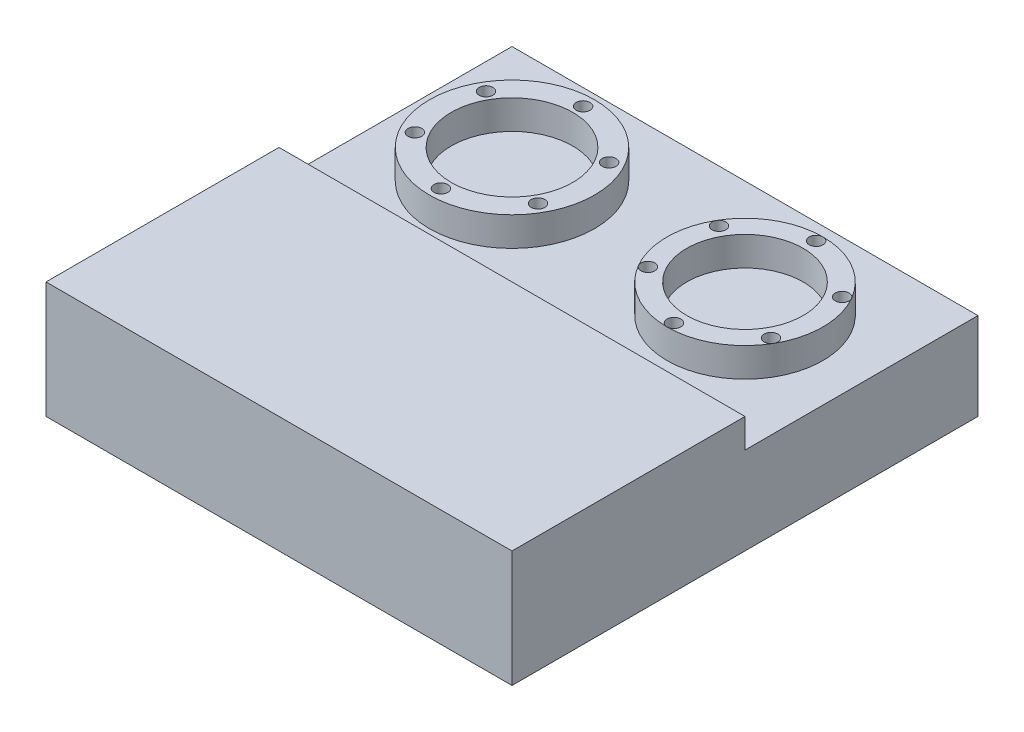
ISO-10303-21;
HEADER;
FILE_DESCRIPTION(('STEP AP214'),'2;1');
FILE_NAME('part.step','',(''),(''),'','','');
FILE_SCHEMA(('AUTOMOTIVE_DESIGN { 1 0 10303 214 1 1 1 1 }'));
ENDSEC;
DATA;
#1=APPLICATION_CONTEXT('core data for automotive mechanical design processes');
#2=APPLICATION_PROTOCOL_DEFINITION('international standard','automotive_design',2000,#1);
#3=PRODUCT_CONTEXT('',#1,'mechanical');
#4=PRODUCT('Part','Part','',(#3));
#5=PRODUCT_RELATED_PRODUCT_CATEGORY('part','',(#4));
#6=PRODUCT_DEFINITION_FORMATION('','',#4);
#7=PRODUCT_DEFINITION_CONTEXT('part definition',#1,'design');
#8=PRODUCT_DEFINITION('design','',#6,#7);
#9=PRODUCT_DEFINITION_SHAPE('','',#8);
#10=(LENGTH_UNIT() NAMED_UNIT(*) SI_UNIT(.MILLI.,.METRE.));
#11=(NAMED_UNIT(*) PLANE_ANGLE_UNIT() SI_UNIT($,.RADIAN.));
#12=(NAMED_UNIT(*) SI_UNIT($,.STERADIAN.) SOLID_ANGLE_UNIT());
#13=UNCERTAINTY_MEASURE_WITH_UNIT(LENGTH_MEASURE(1.E-05),#10,'distance_accuracy_value','');
#14=(GEOMETRIC_REPRESENTATION_CONTEXT(3) GLOBAL_UNCERTAINTY_ASSIGNED_CONTEXT((#13)) GLOBAL_UNIT_ASSIGNED_CONTEXT((#10,
#11,#12)) REPRESENTATION_CONTEXT('',''));
#15=CARTESIAN_POINT('',(0.,0.,0.));
#16=DIRECTION('',(0.,0.,1.));
#17=DIRECTION('',(1.,0.,0.));
#18=AXIS2_PLACEMENT_3D('',#15,#16,#17);
#19=CARTESIAN_POINT('',(0.,19.05,0.));
#20=DIRECTION('',(0.,1.,0.));
#21=DIRECTION('',(0.,0.,1.));
#22=AXIS2_PLACEMENT_3D('',#19,#20,#21);
#23=PLANE('',#22);
#24=CARTESIAN_POINT('',(25.4,19.05,-25.4));
#25=DIRECTION('',(0.,1.,0.));
#26=DIRECTION('',(0.,0.,1.));
#27=AXIS2_PLACEMENT_3D('',#24,#25,#26);
#28=CIRCLE('',#27,17.005);
#29=CARTESIAN_POINT('',(25.4,19.05,-8.39500000000004));
#30=VERTEX_POINT('',#29);
#31=EDGE_CURVE('E301',#30,#30,#28,.T.);
#32=ORIENTED_EDGE('',*,*,#31,.F.);
#33=EDGE_LOOP('',(#32));
#34=FACE_BOUND('',#33,.T.);
#35=CARTESIAN_POINT('',(-25.4,19.05,-25.4));
#36=DIRECTION('',(0.,1.,0.));
#37=DIRECTION('',(0.,0.,1.));
#38=AXIS2_PLACEMENT_3D('',#35,#36,#37);
#39=CIRCLE('',#38,18.);
#40=CARTESIAN_POINT('',(-25.4,19.05,-7.40000000000003));
#41=VERTEX_POINT('',#40);
#42=EDGE_CURVE('E326',#41,#41,#39,.T.);
#43=ORIENTED_EDGE('',*,*,#42,.F.);
#44=EDGE_LOOP('',(#43));
#45=FACE_BOUND('',#44,.T.);
#46=DIRECTION('',(0.,0.,1.));
#47=VECTOR('',#46,1.);
#48=CARTESIAN_POINT('',(-50.8,19.05,50.8));
#49=LINE('',#48,#47);
#50=CARTESIAN_POINT('',(-50.8,19.05,-50.8));
#51=VERTEX_POINT('',#50);
#52=CARTESIAN_POINT('',(-50.8,19.05,0.));
#53=VERTEX_POINT('',#52);
#54=EDGE_CURVE('E90',#51,#53,#49,.T.);
#55=ORIENTED_EDGE('',*,*,#54,.T.);
#56=DIRECTION('',(-1.,0.,0.));
#57=VECTOR('',#56,1.);
#58=CARTESIAN_POINT('',(-50.8,19.05,0.));
#59=LINE('',#58,#57);
#60=CARTESIAN_POINT('',(50.8,19.05,0.));
#61=VERTEX_POINT('',#60);
#62=EDGE_CURVE('E290',#61,#53,#59,.T.);
#63=ORIENTED_EDGE('',*,*,#62,.F.);
#64=DIRECTION('',(0.,0.,-1.));
#65=VECTOR('',#64,1.);
#66=CARTESIAN_POINT('',(50.8,19.05,50.8));
#67=LINE('',#66,#65);
#68=CARTESIAN_POINT('',(50.8,19.05,-50.8));
#69=VERTEX_POINT('',#68);
#70=EDGE_CURVE('E350',#61,#69,#67,.T.);
#71=ORIENTED_EDGE('',*,*,#70,.T.);
#72=DIRECTION('',(-1.,0.,0.));
#73=VECTOR('',#72,1.);
#74=CARTESIAN_POINT('',(50.8,19.05,-50.8));
#75=LINE('',#74,#73);
#76=EDGE_CURVE('E61',#69,#51,#75,.T.);
#77=ORIENTED_EDGE('',*,*,#76,.T.);
#78=EDGE_LOOP('',(#55,#63,#71,#77));
#79=FACE_BOUND('',#78,.T.);
#80=ADVANCED_FACE('F37',(#34,#45,#79),#23,.T.);
#81=CARTESIAN_POINT('',(-50.8,19.05,50.8));
#82=DIRECTION('',(1.,0.,0.));
#83=DIRECTION('',(0.,0.,-1.));
#84=AXIS2_PLACEMENT_3D('',#81,#82,#83);
#85=PLANE('',#84);
#86=DIRECTION('',(0.,0.,1.));
#87=VECTOR('',#86,1.);
#88=CARTESIAN_POINT('',(-50.8,0.,50.8));
#89=LINE('',#88,#87);
#90=CARTESIAN_POINT('',(-50.8,0.,-50.8));
#91=VERTEX_POINT('',#90);
#92=CARTESIAN_POINT('',(-50.8,0.,50.8));
#93=VERTEX_POINT('',#92);
#94=EDGE_CURVE('E96',#91,#93,#89,.T.);
#95=ORIENTED_EDGE('',*,*,#94,.T.);
#96=DIRECTION('',(0.,-1.,0.));
#97=VECTOR('',#96,1.);
#98=CARTESIAN_POINT('',(-50.8,19.05,50.8));
#99=LINE('',#98,#97);
#100=CARTESIAN_POINT('',(-50.8,25.4,50.8));
#101=VERTEX_POINT('',#100);
#102=EDGE_CURVE('E116',#101,#93,#99,.T.);
#103=ORIENTED_EDGE('',*,*,#102,.F.);
#104=DIRECTION('',(0.,0.,1.));
#105=VECTOR('',#104,1.);
#106=CARTESIAN_POINT('',(-50.8,25.4,50.8));
#107=LINE('',#106,#105);
#108=CARTESIAN_POINT('',(-50.8,25.4,0.));
#109=VERTEX_POINT('',#108);
#110=EDGE_CURVE('E280',#109,#101,#107,.T.);
#111=ORIENTED_EDGE('',*,*,#110,.F.);
#112=DIRECTION('',(0.,-1.,0.));
#113=VECTOR('',#112,1.);
#114=CARTESIAN_POINT('',(-50.8,25.4,0.));
#115=LINE('',#114,#113);
#116=EDGE_CURVE('E297',#109,#53,#115,.T.);
#117=ORIENTED_EDGE('',*,*,#116,.T.);
#118=ORIENTED_EDGE('',*,*,#54,.F.);
#119=DIRECTION('',(0.,-1.,0.));
#120=VECTOR('',#119,1.);
#121=CARTESIAN_POINT('',(-50.8,19.05,-50.8));
#122=LINE('',#121,#120);
#123=EDGE_CURVE('E83',#51,#91,#122,.T.);
#124=ORIENTED_EDGE('',*,*,#123,.T.);
#125=EDGE_LOOP('',(#95,#103,#111,#117,#118,#124));
#126=FACE_BOUND('',#125,.T.);
#127=ADVANCED_FACE('F39',(#126),#85,.F.);
#128=CARTESIAN_POINT('',(50.8,19.05,50.8));
#129=DIRECTION('',(0.,0.,-1.));
#130=DIRECTION('',(-1.,0.,0.));
#131=AXIS2_PLACEMENT_3D('',#128,#129,#130);
#132=PLANE('',#131);
#133=DIRECTION('',(1.,0.,0.));
#134=VECTOR('',#133,1.);
#135=CARTESIAN_POINT('',(50.8,0.,50.8));
#136=LINE('',#135,#134);
#137=CARTESIAN_POINT('',(50.8,0.,50.8));
#138=VERTEX_POINT('',#137);
#139=EDGE_CURVE('E100',#93,#138,#136,.T.);
#140=ORIENTED_EDGE('',*,*,#139,.T.);
#141=DIRECTION('',(0.,-1.,0.));
#142=VECTOR('',#141,1.);
#143=CARTESIAN_POINT('',(50.8,19.05,50.8));
#144=LINE('',#143,#142);
#145=CARTESIAN_POINT('',(50.8,25.4,50.8));
#146=VERTEX_POINT('',#145);
#147=EDGE_CURVE('E113',#146,#138,#144,.T.);
#148=ORIENTED_EDGE('',*,*,#147,.F.);
#149=DIRECTION('',(1.,0.,0.));
#150=VECTOR('',#149,1.);
#151=CARTESIAN_POINT('',(-50.8,25.4,50.8));
#152=LINE('',#151,#150);
#153=EDGE_CURVE('E284',#101,#146,#152,.T.);
#154=ORIENTED_EDGE('',*,*,#153,.F.);
#155=ORIENTED_EDGE('',*,*,#102,.T.);
#156=EDGE_LOOP('',(#140,#148,#154,#155));
#157=FACE_BOUND('',#156,.T.);
#158=ADVANCED_FACE('F179',(#157),#132,.F.);
#159=CARTESIAN_POINT('',(50.8,19.05,50.8));
#160=DIRECTION('',(-1.,0.,0.));
#161=DIRECTION('',(0.,0.,1.));
#162=AXIS2_PLACEMENT_3D('',#159,#160,#161);
#163=PLANE('',#162);
#164=DIRECTION('',(0.,0.,-1.));
#165=VECTOR('',#164,1.);
#166=CARTESIAN_POINT('',(50.8,0.,50.8));
#167=LINE('',#166,#165);
#168=CARTESIAN_POINT('',(50.8,0.,-50.8));
#169=VERTEX_POINT('',#168);
#170=EDGE_CURVE('E91',#138,#169,#167,.T.);
#171=ORIENTED_EDGE('',*,*,#170,.T.);
#172=DIRECTION('',(0.,-1.,0.));
#173=VECTOR('',#172,1.);
#174=CARTESIAN_POINT('',(50.8,19.05,-50.8));
#175=LINE('',#174,#173);
#176=EDGE_CURVE('E86',#69,#169,#175,.T.);
#177=ORIENTED_EDGE('',*,*,#176,.F.);
#178=ORIENTED_EDGE('',*,*,#70,.F.);
#179=DIRECTION('',(0.,-1.,0.));
#180=VECTOR('',#179,1.);
#181=CARTESIAN_POINT('',(50.8,25.4,0.));
#182=LINE('',#181,#180);
#183=CARTESIAN_POINT('',(50.8,25.4,0.));
#184=VERTEX_POINT('',#183);
#185=EDGE_CURVE('E52',#184,#61,#182,.T.);
#186=ORIENTED_EDGE('',*,*,#185,.F.);
#187=DIRECTION('',(0.,0.,-1.));
#188=VECTOR('',#187,1.);
#189=CARTESIAN_POINT('',(50.8,25.4,50.8));
#190=LINE('',#189,#188);
#191=EDGE_CURVE('E292',#146,#184,#190,.T.);
#192=ORIENTED_EDGE('',*,*,#191,.F.);
#193=ORIENTED_EDGE('',*,*,#147,.T.);
#194=EDGE_LOOP('',(#171,#177,#178,#186,#192,#193));
#195=FACE_BOUND('',#194,.T.);
#196=ADVANCED_FACE('F353',(#195),#163,.F.);
#197=CARTESIAN_POINT('',(50.8,19.05,-50.8));
#198=DIRECTION('',(0.,0.,1.));
#199=DIRECTION('',(1.,0.,0.));
#200=AXIS2_PLACEMENT_3D('',#197,#198,#199);
#201=PLANE('',#200);
#202=DIRECTION('',(-1.,0.,0.));
#203=VECTOR('',#202,1.);
#204=CARTESIAN_POINT('',(50.8,0.,-50.8));
#205=LINE('',#204,#203);
#206=EDGE_CURVE('E80',#169,#91,#205,.T.);
#207=ORIENTED_EDGE('',*,*,#206,.T.);
#208=ORIENTED_EDGE('',*,*,#123,.F.);
#209=ORIENTED_EDGE('',*,*,#76,.F.);
#210=ORIENTED_EDGE('',*,*,#176,.T.);
#211=EDGE_LOOP('',(#207,#208,#209,#210));
#212=FACE_BOUND('',#211,.T.);
#213=ADVANCED_FACE('F82',(#212),#201,.F.);
#214=CARTESIAN_POINT('',(0.,0.,0.));
#215=DIRECTION('',(0.,1.,0.));
#216=DIRECTION('',(0.,0.,1.));
#217=AXIS2_PLACEMENT_3D('',#214,#215,#216);
#218=PLANE('',#217);
#219=ORIENTED_EDGE('',*,*,#94,.F.);
#220=ORIENTED_EDGE('',*,*,#206,.F.);
#221=ORIENTED_EDGE('',*,*,#170,.F.);
#222=ORIENTED_EDGE('',*,*,#139,.F.);
#223=EDGE_LOOP('',(#219,#220,#221,#222));
#224=FACE_BOUND('',#223,.T.);
#225=ADVANCED_FACE('F99',(#224),#218,.F.);
#226=CARTESIAN_POINT('',(-25.4,25.4,-25.4));
#227=DIRECTION('',(0.,-1.,0.));
#228=DIRECTION('',(0.,0.,-1.));
#229=AXIS2_PLACEMENT_3D('',#226,#227,#228);
#230=CYLINDRICAL_SURFACE('',#229,13.25);
#231=CARTESIAN_POINT('',(-25.4,25.4,-25.4));
#232=DIRECTION('',(0.,1.,0.));
#233=DIRECTION('',(0.,0.,1.));
#234=AXIS2_PLACEMENT_3D('',#231,#232,#233);
#235=CIRCLE('',#234,13.25);
#236=CARTESIAN_POINT('',(-25.4,25.4,-12.15));
#237=VERTEX_POINT('',#236);
#238=EDGE_CURVE('E106',#237,#237,#235,.T.);
#239=ORIENTED_EDGE('',*,*,#238,.T.);
#240=EDGE_LOOP('',(#239));
#241=FACE_BOUND('',#240,.T.);
#242=CARTESIAN_POINT('',(-25.4,19.05,-25.4));
#243=DIRECTION('',(0.,1.,0.));
#244=DIRECTION('',(0.,0.,1.));
#245=AXIS2_PLACEMENT_3D('',#242,#243,#244);
#246=CIRCLE('',#245,13.25);
#247=CARTESIAN_POINT('',(-25.4,19.05,-12.15));
#248=VERTEX_POINT('',#247);
#249=EDGE_CURVE('E136',#248,#248,#246,.F.);
#250=ORIENTED_EDGE('',*,*,#249,.T.);
#251=EDGE_LOOP('',(#250));
#252=FACE_BOUND('',#251,.T.);
#253=ADVANCED_FACE('F226',(#241,#252),#230,.F.);
#254=CARTESIAN_POINT('',(-25.4,25.4,-40.9));
#255=DIRECTION('',(0.,-1.,0.));
#256=DIRECTION('',(0.,0.,-1.));
#257=AXIS2_PLACEMENT_3D('',#254,#255,#256);
#258=CYLINDRICAL_SURFACE('',#257,1.5);
#259=CARTESIAN_POINT('',(-25.4,25.4,-40.9));
#260=DIRECTION('',(0.,1.,0.));
#261=DIRECTION('',(0.,0.,1.));
#262=AXIS2_PLACEMENT_3D('',#259,#260,#261);
#263=CIRCLE('',#262,1.5);
#264=CARTESIAN_POINT('',(-25.4,25.4,-39.4));
#265=VERTEX_POINT('',#264);
#266=EDGE_CURVE('E343',#265,#265,#263,.T.);
#267=ORIENTED_EDGE('',*,*,#266,.T.);
#268=EDGE_LOOP('',(#267));
#269=FACE_BOUND('',#268,.T.);
#270=CARTESIAN_POINT('',(-25.4,19.05,-40.9));
#271=DIRECTION('',(0.,1.,0.));
#272=DIRECTION('',(0.,0.,1.));
#273=AXIS2_PLACEMENT_3D('',#270,#271,#272);
#274=CIRCLE('',#273,1.5);
#275=CARTESIAN_POINT('',(-25.4,19.05,-39.4));
#276=VERTEX_POINT('',#275);
#277=EDGE_CURVE('E133',#276,#276,#274,.F.);
#278=ORIENTED_EDGE('',*,*,#277,.T.);
#279=EDGE_LOOP('',(#278));
#280=FACE_BOUND('',#279,.T.);
#281=ADVANCED_FACE('F222',(#269,#280),#258,.F.);
#282=CARTESIAN_POINT('',(-11.9766062413412,25.4,-33.15));
#283=DIRECTION('',(0.,-1.,0.));
#284=DIRECTION('',(0.,0.,-1.));
#285=AXIS2_PLACEMENT_3D('',#282,#283,#284);
#286=CYLINDRICAL_SURFACE('',#285,1.5);
#287=CARTESIAN_POINT('',(-11.9766062413412,25.4,-33.15));
#288=DIRECTION('',(0.,1.,0.));
#289=DIRECTION('',(0.,0.,1.));
#290=AXIS2_PLACEMENT_3D('',#287,#288,#289);
#291=CIRCLE('',#290,1.5);
#292=CARTESIAN_POINT('',(-11.9766062413412,25.4,-31.65));
#293=VERTEX_POINT('',#292);
#294=EDGE_CURVE('E340',#293,#293,#291,.T.);
#295=ORIENTED_EDGE('',*,*,#294,.T.);
#296=EDGE_LOOP('',(#295));
#297=FACE_BOUND('',#296,.T.);
#298=CARTESIAN_POINT('',(-11.9766062413412,19.05,-33.15));
#299=DIRECTION('',(0.,1.,0.));
#300=DIRECTION('',(0.,0.,1.));
#301=AXIS2_PLACEMENT_3D('',#298,#299,#300);
#302=CIRCLE('',#301,1.5);
#303=CARTESIAN_POINT('',(-11.9766062413412,19.05,-31.65));
#304=VERTEX_POINT('',#303);
#305=EDGE_CURVE('E130',#304,#304,#302,.F.);
#306=ORIENTED_EDGE('',*,*,#305,.T.);
#307=EDGE_LOOP('',(#306));
#308=FACE_BOUND('',#307,.T.);
#309=ADVANCED_FACE('F218',(#297,#308),#286,.F.);
#310=CARTESIAN_POINT('',(-11.9766062413412,25.4,-17.65));
#311=DIRECTION('',(0.,-1.,0.));
#312=DIRECTION('',(0.,0.,-1.));
#313=AXIS2_PLACEMENT_3D('',#310,#311,#312);
#314=CYLINDRICAL_SURFACE('',#313,1.5);
#315=CARTESIAN_POINT('',(-11.9766062413412,25.4,-17.65));
#316=DIRECTION('',(0.,1.,0.));
#317=DIRECTION('',(0.,0.,1.));
#318=AXIS2_PLACEMENT_3D('',#315,#316,#317);
#319=CIRCLE('',#318,1.5);
#320=CARTESIAN_POINT('',(-11.9766062413412,25.4,-16.15));
#321=VERTEX_POINT('',#320);
#322=EDGE_CURVE('E337',#321,#321,#319,.T.);
#323=ORIENTED_EDGE('',*,*,#322,.T.);
#324=EDGE_LOOP('',(#323));
#325=FACE_BOUND('',#324,.T.);
#326=CARTESIAN_POINT('',(-11.9766062413412,19.05,-17.65));
#327=DIRECTION('',(0.,1.,0.));
#328=DIRECTION('',(0.,0.,1.));
#329=AXIS2_PLACEMENT_3D('',#326,#327,#328);
#330=CIRCLE('',#329,1.5);
#331=CARTESIAN_POINT('',(-11.9766062413412,19.05,-16.15));
#332=VERTEX_POINT('',#331);
#333=EDGE_CURVE('E127',#332,#332,#330,.F.);
#334=ORIENTED_EDGE('',*,*,#333,.T.);
#335=EDGE_LOOP('',(#334));
#336=FACE_BOUND('',#335,.T.);
#337=ADVANCED_FACE('F214',(#325,#336),#314,.F.);
#338=CARTESIAN_POINT('',(-25.4,25.4,-9.90000000000005));
#339=DIRECTION('',(0.,-1.,0.));
#340=DIRECTION('',(0.,0.,-1.));
#341=AXIS2_PLACEMENT_3D('',#338,#339,#340);
#342=CYLINDRICAL_SURFACE('',#341,1.5);
#343=CARTESIAN_POINT('',(-25.4,25.4,-9.90000000000005));
#344=DIRECTION('',(0.,1.,0.));
#345=DIRECTION('',(0.,0.,1.));
#346=AXIS2_PLACEMENT_3D('',#343,#344,#345);
#347=CIRCLE('',#346,1.5);
#348=CARTESIAN_POINT('',(-25.4,25.4,-8.40000000000004));
#349=VERTEX_POINT('',#348);
#350=EDGE_CURVE('E334',#349,#349,#347,.T.);
#351=ORIENTED_EDGE('',*,*,#350,.T.);
#352=EDGE_LOOP('',(#351));
#353=FACE_BOUND('',#352,.T.);
#354=CARTESIAN_POINT('',(-25.4,19.05,-9.90000000000005));
#355=DIRECTION('',(0.,1.,0.));
#356=DIRECTION('',(0.,0.,1.));
#357=AXIS2_PLACEMENT_3D('',#354,#355,#356);
#358=CIRCLE('',#357,1.5);
#359=CARTESIAN_POINT('',(-25.4,19.05,-8.40000000000004));
#360=VERTEX_POINT('',#359);
#361=EDGE_CURVE('E124',#360,#360,#358,.F.);
#362=ORIENTED_EDGE('',*,*,#361,.T.);
#363=EDGE_LOOP('',(#362));
#364=FACE_BOUND('',#363,.T.);
#365=ADVANCED_FACE('F207',(#353,#364),#342,.F.);
#366=CARTESIAN_POINT('',(-38.8233937586588,25.4,-17.65));
#367=DIRECTION('',(0.,-1.,0.));
#368=DIRECTION('',(0.,0.,-1.));
#369=AXIS2_PLACEMENT_3D('',#366,#367,#368);
#370=CYLINDRICAL_SURFACE('',#369,1.50000000000001);
#371=CARTESIAN_POINT('',(-38.8233937586588,25.4,-17.65));
#372=DIRECTION('',(0.,1.,0.));
#373=DIRECTION('',(0.,0.,1.));
#374=AXIS2_PLACEMENT_3D('',#371,#372,#373);
#375=CIRCLE('',#374,1.50000000000001);
#376=CARTESIAN_POINT('',(-38.8233937586588,25.4,-16.15));
#377=VERTEX_POINT('',#376);
#378=EDGE_CURVE('E331',#377,#377,#375,.T.);
#379=ORIENTED_EDGE('',*,*,#378,.T.);
#380=EDGE_LOOP('',(#379));
#381=FACE_BOUND('',#380,.T.);
#382=CARTESIAN_POINT('',(-38.8233937586588,19.05,-17.65));
#383=DIRECTION('',(0.,1.,0.));
#384=DIRECTION('',(0.,0.,1.));
#385=AXIS2_PLACEMENT_3D('',#382,#383,#384);
#386=CIRCLE('',#385,1.50000000000001);
#387=CARTESIAN_POINT('',(-38.8233937586588,19.05,-16.15));
#388=VERTEX_POINT('',#387);
#389=EDGE_CURVE('E121',#388,#388,#386,.F.);
#390=ORIENTED_EDGE('',*,*,#389,.T.);
#391=EDGE_LOOP('',(#390));
#392=FACE_BOUND('',#391,.T.);
#393=ADVANCED_FACE('F199',(#381,#392),#370,.F.);
#394=CARTESIAN_POINT('',(-38.8233937586588,25.4,-33.15));
#395=DIRECTION('',(0.,-1.,0.));
#396=DIRECTION('',(0.,0.,-1.));
#397=AXIS2_PLACEMENT_3D('',#394,#395,#396);
#398=CYLINDRICAL_SURFACE('',#397,1.50000000000001);
#399=CARTESIAN_POINT('',(-38.8233937586588,25.4,-33.15));
#400=DIRECTION('',(0.,1.,0.));
#401=DIRECTION('',(0.,0.,1.));
#402=AXIS2_PLACEMENT_3D('',#399,#400,#401);
#403=CIRCLE('',#402,1.50000000000001);
#404=CARTESIAN_POINT('',(-38.8233937586588,25.4,-31.65));
#405=VERTEX_POINT('',#404);
#406=EDGE_CURVE('E329',#405,#405,#403,.T.);
#407=ORIENTED_EDGE('',*,*,#406,.T.);
#408=EDGE_LOOP('',(#407));
#409=FACE_BOUND('',#408,.T.);
#410=CARTESIAN_POINT('',(-38.8233937586588,19.05,-33.15));
#411=DIRECTION('',(0.,1.,0.));
#412=DIRECTION('',(0.,0.,1.));
#413=AXIS2_PLACEMENT_3D('',#410,#411,#412);
#414=CIRCLE('',#413,1.50000000000001);
#415=CARTESIAN_POINT('',(-38.8233937586588,19.05,-31.65));
#416=VERTEX_POINT('',#415);
#417=EDGE_CURVE('E118',#416,#416,#414,.F.);
#418=ORIENTED_EDGE('',*,*,#417,.T.);
#419=EDGE_LOOP('',(#418));
#420=FACE_BOUND('',#419,.T.);
#421=ADVANCED_FACE('F197',(#409,#420),#398,.F.);
#422=CARTESIAN_POINT('',(-25.4,25.4,-25.4));
#423=DIRECTION('',(0.,-1.,0.));
#424=DIRECTION('',(0.,0.,-1.));
#425=AXIS2_PLACEMENT_3D('',#422,#423,#424);
#426=CYLINDRICAL_SURFACE('',#425,18.);
#427=CARTESIAN_POINT('',(-25.4,25.4,-25.4));
#428=DIRECTION('',(0.,1.,0.));
#429=DIRECTION('',(0.,0.,1.));
#430=AXIS2_PLACEMENT_3D('',#427,#428,#429);
#431=CIRCLE('',#430,18.);
#432=CARTESIAN_POINT('',(-25.4,25.4,-7.40000000000003));
#433=VERTEX_POINT('',#432);
#434=EDGE_CURVE('E102',#433,#433,#431,.T.);
#435=ORIENTED_EDGE('',*,*,#434,.F.);
#436=EDGE_LOOP('',(#435));
#437=FACE_BOUND('',#436,.T.);
#438=ORIENTED_EDGE('',*,*,#42,.T.);
#439=EDGE_LOOP('',(#438));
#440=FACE_BOUND('',#439,.T.);
#441=ADVANCED_FACE('F192',(#437,#440),#426,.T.);
#442=CARTESIAN_POINT('',(0.,25.4,0.));
#443=DIRECTION('',(0.,1.,0.));
#444=DIRECTION('',(0.,0.,1.));
#445=AXIS2_PLACEMENT_3D('',#442,#443,#444);
#446=PLANE('',#445);
#447=ORIENTED_EDGE('',*,*,#406,.F.);
#448=EDGE_LOOP('',(#447));
#449=FACE_BOUND('',#448,.T.);
#450=ORIENTED_EDGE('',*,*,#378,.F.);
#451=EDGE_LOOP('',(#450));
#452=FACE_BOUND('',#451,.T.);
#453=ORIENTED_EDGE('',*,*,#350,.F.);
#454=EDGE_LOOP('',(#453));
#455=FACE_BOUND('',#454,.T.);
#456=ORIENTED_EDGE('',*,*,#322,.F.);
#457=EDGE_LOOP('',(#456));
#458=FACE_BOUND('',#457,.T.);
#459=ORIENTED_EDGE('',*,*,#294,.F.);
#460=EDGE_LOOP('',(#459));
#461=FACE_BOUND('',#460,.T.);
#462=ORIENTED_EDGE('',*,*,#266,.F.);
#463=EDGE_LOOP('',(#462));
#464=FACE_BOUND('',#463,.T.);
#465=ORIENTED_EDGE('',*,*,#238,.F.);
#466=EDGE_LOOP('',(#465));
#467=FACE_BOUND('',#466,.T.);
#468=ORIENTED_EDGE('',*,*,#434,.T.);
#469=EDGE_LOOP('',(#468));
#470=FACE_BOUND('',#469,.T.);
#471=ADVANCED_FACE('F184',(#449,#452,#455,#458,#461,#464,#467,#470),#446,.T.);
#472=ORIENTED_EDGE('',*,*,#417,.F.);
#473=EDGE_LOOP('',(#472));
#474=FACE_BOUND('',#473,.T.);
#475=ADVANCED_FACE('F175',(#474),#23,.T.);
#476=ORIENTED_EDGE('',*,*,#389,.F.);
#477=EDGE_LOOP('',(#476));
#478=FACE_BOUND('',#477,.T.);
#479=ADVANCED_FACE('F183',(#478),#23,.T.);
#480=ORIENTED_EDGE('',*,*,#361,.F.);
#481=EDGE_LOOP('',(#480));
#482=FACE_BOUND('',#481,.T.);
#483=ADVANCED_FACE('F190',(#482),#23,.T.);
#484=ORIENTED_EDGE('',*,*,#333,.F.);
#485=EDGE_LOOP('',(#484));
#486=FACE_BOUND('',#485,.T.);
#487=ADVANCED_FACE('F432',(#486),#23,.T.);
#488=ORIENTED_EDGE('',*,*,#305,.F.);
#489=EDGE_LOOP('',(#488));
#490=FACE_BOUND('',#489,.T.);
#491=ADVANCED_FACE('F441',(#490),#23,.T.);
#492=ORIENTED_EDGE('',*,*,#277,.F.);
#493=EDGE_LOOP('',(#492));
#494=FACE_BOUND('',#493,.T.);
#495=ADVANCED_FACE('F450',(#494),#23,.T.);
#496=ORIENTED_EDGE('',*,*,#249,.F.);
#497=EDGE_LOOP('',(#496));
#498=FACE_BOUND('',#497,.T.);
#499=ADVANCED_FACE('F258',(#498),#23,.T.);
#500=CARTESIAN_POINT('',(25.4,25.4,-25.4));
#501=DIRECTION('',(0.,-1.,0.));
#502=DIRECTION('',(0.,0.,-1.));
#503=AXIS2_PLACEMENT_3D('',#500,#501,#502);
#504=CYLINDRICAL_SURFACE('',#503,12.7);
#505=CARTESIAN_POINT('',(25.4,25.4,-25.4));
#506=DIRECTION('',(0.,1.,0.));
#507=DIRECTION('',(0.,0.,1.));
#508=AXIS2_PLACEMENT_3D('',#505,#506,#507);
#509=CIRCLE('',#508,12.7);
#510=CARTESIAN_POINT('',(25.4,25.4,-12.7));
#511=VERTEX_POINT('',#510);
#512=EDGE_CURVE('E320',#511,#511,#509,.T.);
#513=ORIENTED_EDGE('',*,*,#512,.T.);
#514=EDGE_LOOP('',(#513));
#515=FACE_BOUND('',#514,.T.);
#516=CARTESIAN_POINT('',(25.4,19.05,-25.4));
#517=DIRECTION('',(0.,1.,0.));
#518=DIRECTION('',(0.,0.,1.));
#519=AXIS2_PLACEMENT_3D('',#516,#517,#518);
#520=CIRCLE('',#519,12.7);
#521=CARTESIAN_POINT('',(25.4,19.05,-12.7));
#522=VERTEX_POINT('',#521);
#523=EDGE_CURVE('E11',#522,#522,#520,.F.);
#524=ORIENTED_EDGE('',*,*,#523,.T.);
#525=EDGE_LOOP('',(#524));
#526=FACE_BOUND('',#525,.T.);
#527=ADVANCED_FACE('F254',(#515,#526),#504,.F.);
#528=CARTESIAN_POINT('',(25.4,25.4,-40.9));
#529=DIRECTION('',(0.,-1.,0.));
#530=DIRECTION('',(0.,0.,-1.));
#531=AXIS2_PLACEMENT_3D('',#528,#529,#530);
#532=CYLINDRICAL_SURFACE('',#531,1.5);
#533=CARTESIAN_POINT('',(25.4,25.4,-40.9));
#534=DIRECTION('',(0.,1.,0.));
#535=DIRECTION('',(0.,0.,1.));
#536=AXIS2_PLACEMENT_3D('',#533,#534,#535);
#537=CIRCLE('',#536,1.5);
#538=CARTESIAN_POINT('',(25.4,25.4,-39.4));
#539=VERTEX_POINT('',#538);
#540=EDGE_CURVE('E317',#539,#539,#537,.T.);
#541=ORIENTED_EDGE('',*,*,#540,.T.);
#542=EDGE_LOOP('',(#541));
#543=FACE_BOUND('',#542,.T.);
#544=CARTESIAN_POINT('',(25.4,19.05,-40.9));
#545=DIRECTION('',(0.,1.,0.));
#546=DIRECTION('',(0.,0.,1.));
#547=AXIS2_PLACEMENT_3D('',#544,#545,#546);
#548=CIRCLE('',#547,1.5);
#549=CARTESIAN_POINT('',(25.4,19.05,-39.4));
#550=VERTEX_POINT('',#549);
#551=EDGE_CURVE('E45',#550,#550,#548,.F.);
#552=ORIENTED_EDGE('',*,*,#551,.T.);
#553=EDGE_LOOP('',(#552));
#554=FACE_BOUND('',#553,.T.);
#555=ADVANCED_FACE('F156',(#543,#554),#532,.F.);
#556=CARTESIAN_POINT('',(38.8233937586588,25.4,-33.15));
#557=DIRECTION('',(0.,-1.,0.));
#558=DIRECTION('',(0.,0.,-1.));
#559=AXIS2_PLACEMENT_3D('',#556,#557,#558);
#560=CYLINDRICAL_SURFACE('',#559,1.5);
#561=CARTESIAN_POINT('',(38.8233937586588,25.4,-33.15));
#562=DIRECTION('',(0.,1.,0.));
#563=DIRECTION('',(0.,0.,1.));
#564=AXIS2_PLACEMENT_3D('',#561,#562,#563);
#565=CIRCLE('',#564,1.5);
#566=CARTESIAN_POINT('',(38.8233937586588,25.4,-31.65));
#567=VERTEX_POINT('',#566);
#568=EDGE_CURVE('E314',#567,#567,#565,.T.);
#569=ORIENTED_EDGE('',*,*,#568,.T.);
#570=EDGE_LOOP('',(#569));
#571=FACE_BOUND('',#570,.T.);
#572=CARTESIAN_POINT('',(38.8233937586588,19.05,-33.15));
#573=DIRECTION('',(0.,1.,0.));
#574=DIRECTION('',(0.,0.,1.));
#575=AXIS2_PLACEMENT_3D('',#572,#573,#574);
#576=CIRCLE('',#575,1.5);
#577=CARTESIAN_POINT('',(38.8233937586588,19.05,-31.65));
#578=VERTEX_POINT('',#577);
#579=EDGE_CURVE('E151',#578,#578,#576,.F.);
#580=ORIENTED_EDGE('',*,*,#579,.T.);
#581=EDGE_LOOP('',(#580));
#582=FACE_BOUND('',#581,.T.);
#583=ADVANCED_FACE('F247',(#571,#582),#560,.F.);
#584=CARTESIAN_POINT('',(38.8233937586588,25.4,-17.65));
#585=DIRECTION('',(0.,-1.,0.));
#586=DIRECTION('',(0.,0.,-1.));
#587=AXIS2_PLACEMENT_3D('',#584,#585,#586);
#588=CYLINDRICAL_SURFACE('',#587,1.5);
#589=CARTESIAN_POINT('',(38.8233937586588,25.4,-17.65));
#590=DIRECTION('',(0.,1.,0.));
#591=DIRECTION('',(0.,0.,1.));
#592=AXIS2_PLACEMENT_3D('',#589,#590,#591);
#593=CIRCLE('',#592,1.5);
#594=CARTESIAN_POINT('',(38.8233937586588,25.4,-16.15));
#595=VERTEX_POINT('',#594);
#596=EDGE_CURVE('E311',#595,#595,#593,.T.);
#597=ORIENTED_EDGE('',*,*,#596,.T.);
#598=EDGE_LOOP('',(#597));
#599=FACE_BOUND('',#598,.T.);
#600=CARTESIAN_POINT('',(38.8233937586588,19.05,-17.65));
#601=DIRECTION('',(0.,1.,0.));
#602=DIRECTION('',(0.,0.,1.));
#603=AXIS2_PLACEMENT_3D('',#600,#601,#602);
#604=CIRCLE('',#603,1.5);
#605=CARTESIAN_POINT('',(38.8233937586588,19.05,-16.15));
#606=VERTEX_POINT('',#605);
#607=EDGE_CURVE('E148',#606,#606,#604,.F.);
#608=ORIENTED_EDGE('',*,*,#607,.T.);
#609=EDGE_LOOP('',(#608));
#610=FACE_BOUND('',#609,.T.);
#611=ADVANCED_FACE('F243',(#599,#610),#588,.F.);
#612=CARTESIAN_POINT('',(25.4,25.4,-9.90000000000003));
#613=DIRECTION('',(0.,-1.,0.));
#614=DIRECTION('',(0.,0.,-1.));
#615=AXIS2_PLACEMENT_3D('',#612,#613,#614);
#616=CYLINDRICAL_SURFACE('',#615,1.5);
#617=CARTESIAN_POINT('',(25.4,25.4,-9.90000000000003));
#618=DIRECTION('',(0.,1.,0.));
#619=DIRECTION('',(0.,0.,1.));
#620=AXIS2_PLACEMENT_3D('',#617,#618,#619);
#621=CIRCLE('',#620,1.5);
#622=CARTESIAN_POINT('',(25.4,25.4,-8.40000000000003));
#623=VERTEX_POINT('',#622);
#624=EDGE_CURVE('E308',#623,#623,#621,.T.);
#625=ORIENTED_EDGE('',*,*,#624,.T.);
#626=EDGE_LOOP('',(#625));
#627=FACE_BOUND('',#626,.T.);
#628=CARTESIAN_POINT('',(25.4,19.05,-9.90000000000003));
#629=DIRECTION('',(0.,1.,0.));
#630=DIRECTION('',(0.,0.,1.));
#631=AXIS2_PLACEMENT_3D('',#628,#629,#630);
#632=CIRCLE('',#631,1.5);
#633=CARTESIAN_POINT('',(25.4,19.05,-8.40000000000003));
#634=VERTEX_POINT('',#633);
#635=EDGE_CURVE('E145',#634,#634,#632,.F.);
#636=ORIENTED_EDGE('',*,*,#635,.T.);
#637=EDGE_LOOP('',(#636));
#638=FACE_BOUND('',#637,.T.);
#639=ADVANCED_FACE('F239',(#627,#638),#616,.F.);
#640=CARTESIAN_POINT('',(11.9766062413412,25.4,-17.65));
#641=DIRECTION('',(0.,-1.,0.));
#642=DIRECTION('',(0.,0.,-1.));
#643=AXIS2_PLACEMENT_3D('',#640,#641,#642);
#644=CYLINDRICAL_SURFACE('',#643,1.5);
#645=CARTESIAN_POINT('',(11.9766062413412,25.4,-17.65));
#646=DIRECTION('',(0.,1.,0.));
#647=DIRECTION('',(0.,0.,1.));
#648=AXIS2_PLACEMENT_3D('',#645,#646,#647);
#649=CIRCLE('',#648,1.5);
#650=CARTESIAN_POINT('',(11.9766062413412,25.4,-16.15));
#651=VERTEX_POINT('',#650);
#652=EDGE_CURVE('E305',#651,#651,#649,.T.);
#653=ORIENTED_EDGE('',*,*,#652,.T.);
#654=EDGE_LOOP('',(#653));
#655=FACE_BOUND('',#654,.T.);
#656=CARTESIAN_POINT('',(11.9766062413412,19.05,-17.65));
#657=DIRECTION('',(0.,1.,0.));
#658=DIRECTION('',(0.,0.,1.));
#659=AXIS2_PLACEMENT_3D('',#656,#657,#658);
#660=CIRCLE('',#659,1.5);
#661=CARTESIAN_POINT('',(11.9766062413412,19.05,-16.15));
#662=VERTEX_POINT('',#661);
#663=EDGE_CURVE('E142',#662,#662,#660,.F.);
#664=ORIENTED_EDGE('',*,*,#663,.T.);
#665=EDGE_LOOP('',(#664));
#666=FACE_BOUND('',#665,.T.);
#667=ADVANCED_FACE('F235',(#655,#666),#644,.F.);
#668=CARTESIAN_POINT('',(11.9766062413412,25.4,-33.15));
#669=DIRECTION('',(0.,-1.,0.));
#670=DIRECTION('',(0.,0.,-1.));
#671=AXIS2_PLACEMENT_3D('',#668,#669,#670);
#672=CYLINDRICAL_SURFACE('',#671,1.5);
#673=CARTESIAN_POINT('',(11.9766062413412,25.4,-33.15));
#674=DIRECTION('',(0.,1.,0.));
#675=DIRECTION('',(0.,0.,1.));
#676=AXIS2_PLACEMENT_3D('',#673,#674,#675);
#677=CIRCLE('',#676,1.5);
#678=CARTESIAN_POINT('',(11.9766062413412,25.4,-31.65));
#679=VERTEX_POINT('',#678);
#680=EDGE_CURVE('E302',#679,#679,#677,.T.);
#681=ORIENTED_EDGE('',*,*,#680,.T.);
#682=EDGE_LOOP('',(#681));
#683=FACE_BOUND('',#682,.T.);
#684=CARTESIAN_POINT('',(11.9766062413412,19.05,-33.15));
#685=DIRECTION('',(0.,1.,0.));
#686=DIRECTION('',(0.,0.,1.));
#687=AXIS2_PLACEMENT_3D('',#684,#685,#686);
#688=CIRCLE('',#687,1.5);
#689=CARTESIAN_POINT('',(11.9766062413412,19.05,-31.65));
#690=VERTEX_POINT('',#689);
#691=EDGE_CURVE('E139',#690,#690,#688,.F.);
#692=ORIENTED_EDGE('',*,*,#691,.T.);
#693=EDGE_LOOP('',(#692));
#694=FACE_BOUND('',#693,.T.);
#695=ADVANCED_FACE('F231',(#683,#694),#672,.F.);
#696=CARTESIAN_POINT('',(25.4,25.4,-25.4));
#697=DIRECTION('',(0.,-1.,0.));
#698=DIRECTION('',(0.,0.,-1.));
#699=AXIS2_PLACEMENT_3D('',#696,#697,#698);
#700=CYLINDRICAL_SURFACE('',#699,17.005);
#701=CARTESIAN_POINT('',(25.4,25.4,-25.4));
#702=DIRECTION('',(0.,1.,0.));
#703=DIRECTION('',(0.,0.,1.));
#704=AXIS2_PLACEMENT_3D('',#701,#702,#703);
#705=CIRCLE('',#704,17.005);
#706=CARTESIAN_POINT('',(25.4,25.4,-8.39500000000004));
#707=VERTEX_POINT('',#706);
#708=EDGE_CURVE('E323',#707,#707,#705,.T.);
#709=ORIENTED_EDGE('',*,*,#708,.F.);
#710=EDGE_LOOP('',(#709));
#711=FACE_BOUND('',#710,.T.);
#712=ORIENTED_EDGE('',*,*,#31,.T.);
#713=EDGE_LOOP('',(#712));
#714=FACE_BOUND('',#713,.T.);
#715=ADVANCED_FACE('F234',(#711,#714),#700,.T.);
#716=CARTESIAN_POINT('',(0.,25.4,0.));
#717=DIRECTION('',(0.,1.,0.));
#718=DIRECTION('',(0.,0.,1.));
#719=AXIS2_PLACEMENT_3D('',#716,#717,#718);
#720=PLANE('',#719);
#721=ORIENTED_EDGE('',*,*,#680,.F.);
#722=EDGE_LOOP('',(#721));
#723=FACE_BOUND('',#722,.T.);
#724=ORIENTED_EDGE('',*,*,#652,.F.);
#725=EDGE_LOOP('',(#724));
#726=FACE_BOUND('',#725,.T.);
#727=ORIENTED_EDGE('',*,*,#624,.F.);
#728=EDGE_LOOP('',(#727));
#729=FACE_BOUND('',#728,.T.);
#730=ORIENTED_EDGE('',*,*,#596,.F.);
#731=EDGE_LOOP('',(#730));
#732=FACE_BOUND('',#731,.T.);
#733=ORIENTED_EDGE('',*,*,#568,.F.);
#734=EDGE_LOOP('',(#733));
#735=FACE_BOUND('',#734,.T.);
#736=ORIENTED_EDGE('',*,*,#540,.F.);
#737=EDGE_LOOP('',(#736));
#738=FACE_BOUND('',#737,.T.);
#739=ORIENTED_EDGE('',*,*,#512,.F.);
#740=EDGE_LOOP('',(#739));
#741=FACE_BOUND('',#740,.T.);
#742=ORIENTED_EDGE('',*,*,#708,.T.);
#743=EDGE_LOOP('',(#742));
#744=FACE_BOUND('',#743,.T.);
#745=ADVANCED_FACE('F262',(#723,#726,#729,#732,#735,#738,#741,#744),#720,.T.);
#746=ORIENTED_EDGE('',*,*,#691,.F.);
#747=EDGE_LOOP('',(#746));
#748=FACE_BOUND('',#747,.T.);
#749=ADVANCED_FACE('F266',(#748),#23,.T.);
#750=ORIENTED_EDGE('',*,*,#663,.F.);
#751=EDGE_LOOP('',(#750));
#752=FACE_BOUND('',#751,.T.);
#753=ADVANCED_FACE('F531',(#752),#23,.T.);
#754=ORIENTED_EDGE('',*,*,#635,.F.);
#755=EDGE_LOOP('',(#754));
#756=FACE_BOUND('',#755,.T.);
#757=ADVANCED_FACE('F540',(#756),#23,.T.);
#758=ORIENTED_EDGE('',*,*,#607,.F.);
#759=EDGE_LOOP('',(#758));
#760=FACE_BOUND('',#759,.T.);
#761=ADVANCED_FACE('F169',(#760),#23,.T.);
#762=ORIENTED_EDGE('',*,*,#579,.F.);
#763=EDGE_LOOP('',(#762));
#764=FACE_BOUND('',#763,.T.);
#765=ADVANCED_FACE('F161',(#764),#23,.T.);
#766=ORIENTED_EDGE('',*,*,#551,.F.);
#767=EDGE_LOOP('',(#766));
#768=FACE_BOUND('',#767,.T.);
#769=ADVANCED_FACE('F158',(#768),#23,.T.);
#770=ORIENTED_EDGE('',*,*,#523,.F.);
#771=EDGE_LOOP('',(#770));
#772=FACE_BOUND('',#771,.T.);
#773=ADVANCED_FACE('F160',(#772),#23,.T.);
#774=CARTESIAN_POINT('',(-50.8,25.4,0.));
#775=DIRECTION('',(0.,0.,1.));
#776=DIRECTION('',(1.,0.,0.));
#777=AXIS2_PLACEMENT_3D('',#774,#775,#776);
#778=PLANE('',#777);
#779=ORIENTED_EDGE('',*,*,#62,.T.);
#780=ORIENTED_EDGE('',*,*,#116,.F.);
#781=DIRECTION('',(-1.,0.,0.));
#782=VECTOR('',#781,1.);
#783=CARTESIAN_POINT('',(-50.8,25.4,0.));
#784=LINE('',#783,#782);
#785=EDGE_CURVE('E286',#184,#109,#784,.T.);
#786=ORIENTED_EDGE('',*,*,#785,.F.);
#787=ORIENTED_EDGE('',*,*,#185,.T.);
#788=EDGE_LOOP('',(#779,#780,#786,#787));
#789=FACE_BOUND('',#788,.T.);
#790=ADVANCED_FACE('F167',(#789),#778,.F.);
#791=CARTESIAN_POINT('',(0.,25.4,0.));
#792=DIRECTION('',(0.,-1.,0.));
#793=DIRECTION('',(0.,0.,-1.));
#794=AXIS2_PLACEMENT_3D('',#791,#792,#793);
#795=PLANE('',#794);
#796=ORIENTED_EDGE('',*,*,#110,.T.);
#797=ORIENTED_EDGE('',*,*,#153,.T.);
#798=ORIENTED_EDGE('',*,*,#191,.T.);
#799=ORIENTED_EDGE('',*,*,#785,.T.);
#800=EDGE_LOOP('',(#796,#797,#798,#799));
#801=FACE_BOUND('',#800,.T.);
#802=ADVANCED_FACE('F270',(#801),#795,.F.);
#803=CLOSED_SHELL('',(#80,#127,#158,#196,#213,#225,#253,#281,#309,#337,#365,#393,#421,#441,#471,
#475,#479,#483,#487,#491,#495,#499,#527,#555,#583,#611,#639,#667,#695,#715,#745,#749,#753,#757,
#761,#765,#769,#773,#790,#802));
#804=MANIFOLD_SOLID_BREP('B2',#803);
#805=ADVANCED_BREP_SHAPE_REPRESENTATION('',(#18,#804),#14);
#806=SHAPE_DEFINITION_REPRESENTATION(#9,#805);
ENDSEC;
END-ISO-10303-21;
